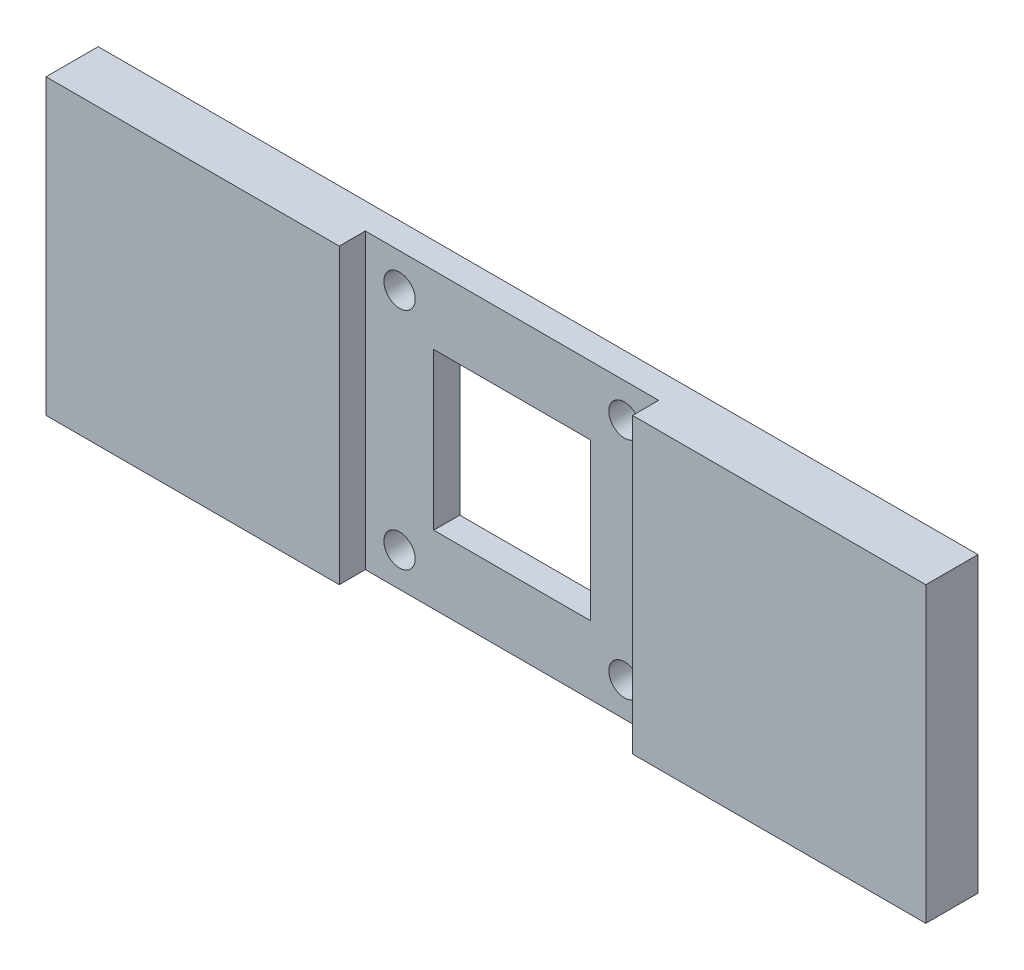
ISO-10303-21;
HEADER;
FILE_DESCRIPTION(('STEP AP214'),'2;1');
FILE_NAME('part.step','',(''),(''),'','','');
FILE_SCHEMA(('AUTOMOTIVE_DESIGN { 1 0 10303 214 1 1 1 1 }'));
ENDSEC;
DATA;
#1=APPLICATION_CONTEXT('core data for automotive mechanical design processes');
#2=APPLICATION_PROTOCOL_DEFINITION('international standard','automotive_design',2000,#1);
#3=PRODUCT_CONTEXT('',#1,'mechanical');
#4=PRODUCT('Part','Part','',(#3));
#5=PRODUCT_RELATED_PRODUCT_CATEGORY('part','',(#4));
#6=PRODUCT_DEFINITION_FORMATION('','',#4);
#7=PRODUCT_DEFINITION_CONTEXT('part definition',#1,'design');
#8=PRODUCT_DEFINITION('design','',#6,#7);
#9=PRODUCT_DEFINITION_SHAPE('','',#8);
#10=(LENGTH_UNIT() NAMED_UNIT(*) SI_UNIT(.MILLI.,.METRE.));
#11=(NAMED_UNIT(*) PLANE_ANGLE_UNIT() SI_UNIT($,.RADIAN.));
#12=(NAMED_UNIT(*) SI_UNIT($,.STERADIAN.) SOLID_ANGLE_UNIT());
#13=UNCERTAINTY_MEASURE_WITH_UNIT(LENGTH_MEASURE(1.E-05),#10,'distance_accuracy_value','');
#14=(GEOMETRIC_REPRESENTATION_CONTEXT(3) GLOBAL_UNCERTAINTY_ASSIGNED_CONTEXT((#13)) GLOBAL_UNIT_ASSIGNED_CONTEXT((#10,
#11,#12)) REPRESENTATION_CONTEXT('',''));
#15=CARTESIAN_POINT('',(0.,0.,0.));
#16=DIRECTION('',(0.,0.,1.));
#17=DIRECTION('',(1.,0.,0.));
#18=AXIS2_PLACEMENT_3D('',#15,#16,#17);
#19=CARTESIAN_POINT('',(-175.,28.1,10.));
#20=DIRECTION('',(0.,-1.,0.));
#21=DIRECTION('',(0.,0.,-1.));
#22=AXIS2_PLACEMENT_3D('',#19,#20,#21);
#23=PLANE('',#22);
#24=DIRECTION('',(-1.,0.,0.));
#25=VECTOR('',#24,1.);
#26=CARTESIAN_POINT('',(-175.,28.1,10.));
#27=LINE('',#26,#25);
#28=CARTESIAN_POINT('',(84.3,28.1,10.));
#29=VERTEX_POINT('',#28);
#30=CARTESIAN_POINT('',(28.1,28.1,10.));
#31=VERTEX_POINT('',#30);
#32=EDGE_CURVE('E142',#29,#31,#27,.T.);
#33=ORIENTED_EDGE('',*,*,#32,.F.);
#34=DIRECTION('',(0.,0.,1.));
#35=VECTOR('',#34,1.);
#36=CARTESIAN_POINT('',(84.3,28.1,0.));
#37=LINE('',#36,#35);
#38=CARTESIAN_POINT('',(84.3,28.1,0.));
#39=VERTEX_POINT('',#38);
#40=EDGE_CURVE('E11',#39,#29,#37,.T.);
#41=ORIENTED_EDGE('',*,*,#40,.F.);
#42=DIRECTION('',(-1.,0.,0.));
#43=VECTOR('',#42,1.);
#44=CARTESIAN_POINT('',(-175.,28.1,0.));
#45=LINE('',#44,#43);
#46=CARTESIAN_POINT('',(-84.3,28.1,0.));
#47=VERTEX_POINT('',#46);
#48=EDGE_CURVE('E139',#39,#47,#45,.T.);
#49=ORIENTED_EDGE('',*,*,#48,.T.);
#50=DIRECTION('',(0.,0.,1.));
#51=VECTOR('',#50,1.);
#52=CARTESIAN_POINT('',(-84.3,28.1,0.));
#53=LINE('',#52,#51);
#54=CARTESIAN_POINT('',(-84.3,28.1,10.));
#55=VERTEX_POINT('',#54);
#56=EDGE_CURVE('E152',#47,#55,#53,.T.);
#57=ORIENTED_EDGE('',*,*,#56,.T.);
#58=CARTESIAN_POINT('',(-28.1,28.1,10.));
#59=VERTEX_POINT('',#58);
#60=EDGE_CURVE('E161',#59,#55,#27,.T.);
#61=ORIENTED_EDGE('',*,*,#60,.F.);
#62=DIRECTION('',(0.,0.,1.));
#63=VECTOR('',#62,1.);
#64=CARTESIAN_POINT('',(-28.1,28.1,5.));
#65=LINE('',#64,#63);
#66=CARTESIAN_POINT('',(-28.1,28.1,5.));
#67=VERTEX_POINT('',#66);
#68=EDGE_CURVE('E164',#67,#59,#65,.T.);
#69=ORIENTED_EDGE('',*,*,#68,.F.);
#70=DIRECTION('',(-1.,0.,0.));
#71=VECTOR('',#70,1.);
#72=CARTESIAN_POINT('',(-28.1,28.1,5.));
#73=LINE('',#72,#71);
#74=CARTESIAN_POINT('',(28.1,28.1,5.));
#75=VERTEX_POINT('',#74);
#76=EDGE_CURVE('E192',#75,#67,#73,.T.);
#77=ORIENTED_EDGE('',*,*,#76,.F.);
#78=DIRECTION('',(0.,0.,1.));
#79=VECTOR('',#78,1.);
#80=CARTESIAN_POINT('',(28.1,28.1,5.));
#81=LINE('',#80,#79);
#82=EDGE_CURVE('E148',#75,#31,#81,.T.);
#83=ORIENTED_EDGE('',*,*,#82,.T.);
#84=EDGE_LOOP('',(#33,#41,#49,#57,#61,#69,#77,#83));
#85=FACE_BOUND('',#84,.T.);
#86=ADVANCED_FACE('F38',(#85),#23,.F.);
#87=CARTESIAN_POINT('',(-175.,-28.1,10.));
#88=DIRECTION('',(0.,1.,0.));
#89=DIRECTION('',(0.,0.,1.));
#90=AXIS2_PLACEMENT_3D('',#87,#88,#89);
#91=PLANE('',#90);
#92=DIRECTION('',(1.,0.,0.));
#93=VECTOR('',#92,1.);
#94=CARTESIAN_POINT('',(-175.,-28.1,0.));
#95=LINE('',#94,#93);
#96=CARTESIAN_POINT('',(-84.3,-28.1,0.));
#97=VERTEX_POINT('',#96);
#98=CARTESIAN_POINT('',(84.3,-28.1,0.));
#99=VERTEX_POINT('',#98);
#100=EDGE_CURVE('E130',#97,#99,#95,.T.);
#101=ORIENTED_EDGE('',*,*,#100,.T.);
#102=DIRECTION('',(0.,0.,1.));
#103=VECTOR('',#102,1.);
#104=CARTESIAN_POINT('',(84.3,-28.1,0.));
#105=LINE('',#104,#103);
#106=CARTESIAN_POINT('',(84.3,-28.1,10.));
#107=VERTEX_POINT('',#106);
#108=EDGE_CURVE('E121',#99,#107,#105,.T.);
#109=ORIENTED_EDGE('',*,*,#108,.T.);
#110=DIRECTION('',(1.,0.,0.));
#111=VECTOR('',#110,1.);
#112=CARTESIAN_POINT('',(-175.,-28.1,10.));
#113=LINE('',#112,#111);
#114=CARTESIAN_POINT('',(28.1,-28.1,10.));
#115=VERTEX_POINT('',#114);
#116=EDGE_CURVE('E160',#115,#107,#113,.T.);
#117=ORIENTED_EDGE('',*,*,#116,.F.);
#118=DIRECTION('',(0.,0.,1.));
#119=VECTOR('',#118,1.);
#120=CARTESIAN_POINT('',(28.1,-28.1,5.));
#121=LINE('',#120,#119);
#122=CARTESIAN_POINT('',(28.1,-28.1,5.));
#123=VERTEX_POINT('',#122);
#124=EDGE_CURVE('E172',#123,#115,#121,.T.);
#125=ORIENTED_EDGE('',*,*,#124,.F.);
#126=DIRECTION('',(1.,0.,0.));
#127=VECTOR('',#126,1.);
#128=CARTESIAN_POINT('',(-28.1,-28.1,5.));
#129=LINE('',#128,#127);
#130=CARTESIAN_POINT('',(-28.1,-28.1,5.));
#131=VERTEX_POINT('',#130);
#132=EDGE_CURVE('E183',#131,#123,#129,.T.);
#133=ORIENTED_EDGE('',*,*,#132,.F.);
#134=DIRECTION('',(0.,0.,1.));
#135=VECTOR('',#134,1.);
#136=CARTESIAN_POINT('',(-28.1,-28.1,5.));
#137=LINE('',#136,#135);
#138=CARTESIAN_POINT('',(-28.1,-28.1,10.));
#139=VERTEX_POINT('',#138);
#140=EDGE_CURVE('E129',#131,#139,#137,.T.);
#141=ORIENTED_EDGE('',*,*,#140,.T.);
#142=CARTESIAN_POINT('',(-84.3,-28.1,10.));
#143=VERTEX_POINT('',#142);
#144=EDGE_CURVE('E157',#143,#139,#113,.T.);
#145=ORIENTED_EDGE('',*,*,#144,.F.);
#146=DIRECTION('',(0.,0.,1.));
#147=VECTOR('',#146,1.);
#148=CARTESIAN_POINT('',(-84.3,-28.1,0.));
#149=LINE('',#148,#147);
#150=EDGE_CURVE('E146',#97,#143,#149,.T.);
#151=ORIENTED_EDGE('',*,*,#150,.F.);
#152=EDGE_LOOP('',(#101,#109,#117,#125,#133,#141,#145,#151));
#153=FACE_BOUND('',#152,.T.);
#154=ADVANCED_FACE('F144',(#153),#91,.F.);
#155=CARTESIAN_POINT('',(0.,0.,10.));
#156=DIRECTION('',(0.,0.,-1.));
#157=DIRECTION('',(-1.,0.,0.));
#158=AXIS2_PLACEMENT_3D('',#155,#156,#157);
#159=PLANE('',#158);
#160=ORIENTED_EDGE('',*,*,#60,.T.);
#161=DIRECTION('',(0.,1.,0.));
#162=VECTOR('',#161,1.);
#163=CARTESIAN_POINT('',(-84.3,28.1,10.));
#164=LINE('',#163,#162);
#165=EDGE_CURVE('E255',#143,#55,#164,.T.);
#166=ORIENTED_EDGE('',*,*,#165,.F.);
#167=ORIENTED_EDGE('',*,*,#144,.T.);
#168=DIRECTION('',(0.,-1.,0.));
#169=VECTOR('',#168,1.);
#170=CARTESIAN_POINT('',(-28.1,-28.1,10.));
#171=LINE('',#170,#169);
#172=EDGE_CURVE('E168',#59,#139,#171,.T.);
#173=ORIENTED_EDGE('',*,*,#172,.F.);
#174=EDGE_LOOP('',(#160,#166,#167,#173));
#175=FACE_BOUND('',#174,.T.);
#176=ADVANCED_FACE('F290',(#175),#159,.F.);
#177=ORIENTED_EDGE('',*,*,#116,.T.);
#178=DIRECTION('',(0.,-1.,0.));
#179=VECTOR('',#178,1.);
#180=CARTESIAN_POINT('',(84.3,28.1,10.));
#181=LINE('',#180,#179);
#182=EDGE_CURVE('E48',#29,#107,#181,.T.);
#183=ORIENTED_EDGE('',*,*,#182,.F.);
#184=ORIENTED_EDGE('',*,*,#32,.T.);
#185=DIRECTION('',(0.,1.,0.));
#186=VECTOR('',#185,1.);
#187=CARTESIAN_POINT('',(28.1,-28.1,10.));
#188=LINE('',#187,#186);
#189=EDGE_CURVE('E175',#115,#31,#188,.T.);
#190=ORIENTED_EDGE('',*,*,#189,.F.);
#191=EDGE_LOOP('',(#177,#183,#184,#190));
#192=FACE_BOUND('',#191,.T.);
#193=ADVANCED_FACE('F317',(#192),#159,.F.);
#194=CARTESIAN_POINT('',(0.,0.,0.));
#195=DIRECTION('',(0.,0.,-1.));
#196=DIRECTION('',(-1.,0.,0.));
#197=AXIS2_PLACEMENT_3D('',#194,#195,#196);
#198=PLANE('',#197);
#199=DIRECTION('',(0.,-1.,0.));
#200=VECTOR('',#199,1.);
#201=CARTESIAN_POINT('',(84.3,28.1,0.));
#202=LINE('',#201,#200);
#203=EDGE_CURVE('E41',#39,#99,#202,.T.);
#204=ORIENTED_EDGE('',*,*,#203,.T.);
#205=ORIENTED_EDGE('',*,*,#100,.F.);
#206=DIRECTION('',(0.,1.,0.));
#207=VECTOR('',#206,1.);
#208=CARTESIAN_POINT('',(-84.3,28.1,0.));
#209=LINE('',#208,#207);
#210=EDGE_CURVE('E141',#97,#47,#209,.T.);
#211=ORIENTED_EDGE('',*,*,#210,.T.);
#212=ORIENTED_EDGE('',*,*,#48,.F.);
#213=EDGE_LOOP('',(#204,#205,#211,#212));
#214=FACE_BOUND('',#213,.T.);
#215=CARTESIAN_POINT('',(21.55,-21.55,0.));
#216=DIRECTION('',(0.,0.,1.));
#217=DIRECTION('',(1.,0.,0.));
#218=AXIS2_PLACEMENT_3D('',#215,#216,#217);
#219=CIRCLE('',#218,3.);
#220=CARTESIAN_POINT('',(24.55,-21.55,0.));
#221=VERTEX_POINT('',#220);
#222=EDGE_CURVE('E257',#221,#221,#219,.T.);
#223=ORIENTED_EDGE('',*,*,#222,.T.);
#224=EDGE_LOOP('',(#223));
#225=FACE_BOUND('',#224,.T.);
#226=CARTESIAN_POINT('',(-21.55,21.55,0.));
#227=DIRECTION('',(0.,0.,1.));
#228=DIRECTION('',(1.,0.,0.));
#229=AXIS2_PLACEMENT_3D('',#226,#227,#228);
#230=CIRCLE('',#229,3.);
#231=CARTESIAN_POINT('',(-18.55,21.55,0.));
#232=VERTEX_POINT('',#231);
#233=EDGE_CURVE('E261',#232,#232,#230,.T.);
#234=ORIENTED_EDGE('',*,*,#233,.T.);
#235=EDGE_LOOP('',(#234));
#236=FACE_BOUND('',#235,.T.);
#237=CARTESIAN_POINT('',(-21.55,-21.55,0.));
#238=DIRECTION('',(0.,0.,1.));
#239=DIRECTION('',(1.,0.,0.));
#240=AXIS2_PLACEMENT_3D('',#237,#238,#239);
#241=CIRCLE('',#240,3.);
#242=CARTESIAN_POINT('',(-18.55,-21.55,0.));
#243=VERTEX_POINT('',#242);
#244=EDGE_CURVE('E250',#243,#243,#241,.T.);
#245=ORIENTED_EDGE('',*,*,#244,.T.);
#246=EDGE_LOOP('',(#245));
#247=FACE_BOUND('',#246,.T.);
#248=CARTESIAN_POINT('',(21.55,21.55,0.));
#249=DIRECTION('',(0.,0.,1.));
#250=DIRECTION('',(1.,0.,0.));
#251=AXIS2_PLACEMENT_3D('',#248,#249,#250);
#252=CIRCLE('',#251,3.);
#253=CARTESIAN_POINT('',(24.55,21.55,0.));
#254=VERTEX_POINT('',#253);
#255=EDGE_CURVE('E242',#254,#254,#252,.T.);
#256=ORIENTED_EDGE('',*,*,#255,.T.);
#257=EDGE_LOOP('',(#256));
#258=FACE_BOUND('',#257,.T.);
#259=DIRECTION('',(0.,1.,0.));
#260=VECTOR('',#259,1.);
#261=CARTESIAN_POINT('',(15.,-15.,0.));
#262=LINE('',#261,#260);
#263=CARTESIAN_POINT('',(15.,-15.,0.));
#264=VERTEX_POINT('',#263);
#265=CARTESIAN_POINT('',(15.,15.,0.));
#266=VERTEX_POINT('',#265);
#267=EDGE_CURVE('E238',#264,#266,#262,.T.);
#268=ORIENTED_EDGE('',*,*,#267,.T.);
#269=DIRECTION('',(-1.,0.,0.));
#270=VECTOR('',#269,1.);
#271=CARTESIAN_POINT('',(-15.,15.,0.));
#272=LINE('',#271,#270);
#273=CARTESIAN_POINT('',(-15.,15.,0.));
#274=VERTEX_POINT('',#273);
#275=EDGE_CURVE('E234',#266,#274,#272,.T.);
#276=ORIENTED_EDGE('',*,*,#275,.T.);
#277=DIRECTION('',(0.,-1.,0.));
#278=VECTOR('',#277,1.);
#279=CARTESIAN_POINT('',(-15.,-15.,0.));
#280=LINE('',#279,#278);
#281=CARTESIAN_POINT('',(-15.,-15.,0.));
#282=VERTEX_POINT('',#281);
#283=EDGE_CURVE('E230',#274,#282,#280,.T.);
#284=ORIENTED_EDGE('',*,*,#283,.T.);
#285=DIRECTION('',(1.,0.,0.));
#286=VECTOR('',#285,1.);
#287=CARTESIAN_POINT('',(-15.,-15.,0.));
#288=LINE('',#287,#286);
#289=EDGE_CURVE('E182',#282,#264,#288,.T.);
#290=ORIENTED_EDGE('',*,*,#289,.T.);
#291=EDGE_LOOP('',(#268,#276,#284,#290));
#292=FACE_BOUND('',#291,.T.);
#293=ADVANCED_FACE('F135',(#214,#225,#236,#247,#258,#292),#198,.T.);
#294=CARTESIAN_POINT('',(28.1,-28.1,5.));
#295=DIRECTION('',(1.,0.,0.));
#296=DIRECTION('',(0.,0.,-1.));
#297=AXIS2_PLACEMENT_3D('',#294,#295,#296);
#298=PLANE('',#297);
#299=ORIENTED_EDGE('',*,*,#189,.T.);
#300=ORIENTED_EDGE('',*,*,#82,.F.);
#301=DIRECTION('',(0.,1.,0.));
#302=VECTOR('',#301,1.);
#303=CARTESIAN_POINT('',(28.1,-28.1,5.));
#304=LINE('',#303,#302);
#305=EDGE_CURVE('E167',#123,#75,#304,.T.);
#306=ORIENTED_EDGE('',*,*,#305,.F.);
#307=ORIENTED_EDGE('',*,*,#124,.T.);
#308=EDGE_LOOP('',(#299,#300,#306,#307));
#309=FACE_BOUND('',#308,.T.);
#310=ADVANCED_FACE('F325',(#309),#298,.F.);
#311=CARTESIAN_POINT('',(-28.1,-28.1,5.));
#312=DIRECTION('',(-1.,0.,0.));
#313=DIRECTION('',(0.,0.,1.));
#314=AXIS2_PLACEMENT_3D('',#311,#312,#313);
#315=PLANE('',#314);
#316=ORIENTED_EDGE('',*,*,#172,.T.);
#317=ORIENTED_EDGE('',*,*,#140,.F.);
#318=DIRECTION('',(0.,-1.,0.));
#319=VECTOR('',#318,1.);
#320=CARTESIAN_POINT('',(-28.1,-28.1,5.));
#321=LINE('',#320,#319);
#322=EDGE_CURVE('E188',#67,#131,#321,.T.);
#323=ORIENTED_EDGE('',*,*,#322,.F.);
#324=ORIENTED_EDGE('',*,*,#68,.T.);
#325=EDGE_LOOP('',(#316,#317,#323,#324));
#326=FACE_BOUND('',#325,.T.);
#327=ADVANCED_FACE('F328',(#326),#315,.F.);
#328=CARTESIAN_POINT('',(0.,0.,5.));
#329=DIRECTION('',(0.,0.,-1.));
#330=DIRECTION('',(-1.,0.,0.));
#331=AXIS2_PLACEMENT_3D('',#328,#329,#330);
#332=PLANE('',#331);
#333=CARTESIAN_POINT('',(21.55,-21.55,5.));
#334=DIRECTION('',(0.,0.,1.));
#335=DIRECTION('',(1.,0.,0.));
#336=AXIS2_PLACEMENT_3D('',#333,#334,#335);
#337=CIRCLE('',#336,3.);
#338=CARTESIAN_POINT('',(24.55,-21.55,5.));
#339=VERTEX_POINT('',#338);
#340=EDGE_CURVE('E251',#339,#339,#337,.T.);
#341=ORIENTED_EDGE('',*,*,#340,.F.);
#342=EDGE_LOOP('',(#341));
#343=FACE_BOUND('',#342,.T.);
#344=CARTESIAN_POINT('',(-21.55,21.55,5.));
#345=DIRECTION('',(0.,0.,1.));
#346=DIRECTION('',(1.,0.,0.));
#347=AXIS2_PLACEMENT_3D('',#344,#345,#346);
#348=CIRCLE('',#347,3.);
#349=CARTESIAN_POINT('',(-18.55,21.55,5.));
#350=VERTEX_POINT('',#349);
#351=EDGE_CURVE('E256',#350,#350,#348,.T.);
#352=ORIENTED_EDGE('',*,*,#351,.F.);
#353=EDGE_LOOP('',(#352));
#354=FACE_BOUND('',#353,.T.);
#355=CARTESIAN_POINT('',(-21.55,-21.55,5.));
#356=DIRECTION('',(0.,0.,1.));
#357=DIRECTION('',(1.,0.,0.));
#358=AXIS2_PLACEMENT_3D('',#355,#356,#357);
#359=CIRCLE('',#358,3.);
#360=CARTESIAN_POINT('',(-18.55,-21.55,5.));
#361=VERTEX_POINT('',#360);
#362=EDGE_CURVE('E246',#361,#361,#359,.T.);
#363=ORIENTED_EDGE('',*,*,#362,.F.);
#364=EDGE_LOOP('',(#363));
#365=FACE_BOUND('',#364,.T.);
#366=CARTESIAN_POINT('',(21.55,21.55,5.));
#367=DIRECTION('',(0.,0.,1.));
#368=DIRECTION('',(1.,0.,0.));
#369=AXIS2_PLACEMENT_3D('',#366,#367,#368);
#370=CIRCLE('',#369,3.);
#371=CARTESIAN_POINT('',(24.55,21.55,5.));
#372=VERTEX_POINT('',#371);
#373=EDGE_CURVE('E203',#372,#372,#370,.T.);
#374=ORIENTED_EDGE('',*,*,#373,.F.);
#375=EDGE_LOOP('',(#374));
#376=FACE_BOUND('',#375,.T.);
#377=DIRECTION('',(-1.,0.,0.));
#378=VECTOR('',#377,1.);
#379=CARTESIAN_POINT('',(-15.,15.,5.));
#380=LINE('',#379,#378);
#381=CARTESIAN_POINT('',(15.,15.,5.));
#382=VERTEX_POINT('',#381);
#383=CARTESIAN_POINT('',(-15.,15.,5.));
#384=VERTEX_POINT('',#383);
#385=EDGE_CURVE('E204',#382,#384,#380,.T.);
#386=ORIENTED_EDGE('',*,*,#385,.F.);
#387=DIRECTION('',(0.,1.,0.));
#388=VECTOR('',#387,1.);
#389=CARTESIAN_POINT('',(15.,-15.,5.));
#390=LINE('',#389,#388);
#391=CARTESIAN_POINT('',(15.,-15.,5.));
#392=VERTEX_POINT('',#391);
#393=EDGE_CURVE('E187',#392,#382,#390,.T.);
#394=ORIENTED_EDGE('',*,*,#393,.F.);
#395=DIRECTION('',(1.,0.,0.));
#396=VECTOR('',#395,1.);
#397=CARTESIAN_POINT('',(-15.,-15.,5.));
#398=LINE('',#397,#396);
#399=CARTESIAN_POINT('',(-15.,-15.,5.));
#400=VERTEX_POINT('',#399);
#401=EDGE_CURVE('E212',#400,#392,#398,.T.);
#402=ORIENTED_EDGE('',*,*,#401,.F.);
#403=DIRECTION('',(0.,-1.,0.));
#404=VECTOR('',#403,1.);
#405=CARTESIAN_POINT('',(-15.,-15.,5.));
#406=LINE('',#405,#404);
#407=EDGE_CURVE('E208',#384,#400,#406,.T.);
#408=ORIENTED_EDGE('',*,*,#407,.F.);
#409=EDGE_LOOP('',(#386,#394,#402,#408));
#410=FACE_BOUND('',#409,.T.);
#411=ORIENTED_EDGE('',*,*,#305,.T.);
#412=ORIENTED_EDGE('',*,*,#76,.T.);
#413=ORIENTED_EDGE('',*,*,#322,.T.);
#414=ORIENTED_EDGE('',*,*,#132,.T.);
#415=EDGE_LOOP('',(#411,#412,#413,#414));
#416=FACE_BOUND('',#415,.T.);
#417=ADVANCED_FACE('F332',(#343,#354,#365,#376,#410,#416),#332,.F.);
#418=CARTESIAN_POINT('',(15.,-15.,0.));
#419=DIRECTION('',(1.,0.,0.));
#420=DIRECTION('',(0.,0.,-1.));
#421=AXIS2_PLACEMENT_3D('',#418,#419,#420);
#422=PLANE('',#421);
#423=ORIENTED_EDGE('',*,*,#393,.T.);
#424=DIRECTION('',(0.,0.,1.));
#425=VECTOR('',#424,1.);
#426=CARTESIAN_POINT('',(15.,15.,0.));
#427=LINE('',#426,#425);
#428=EDGE_CURVE('E199',#266,#382,#427,.T.);
#429=ORIENTED_EDGE('',*,*,#428,.F.);
#430=ORIENTED_EDGE('',*,*,#267,.F.);
#431=DIRECTION('',(0.,0.,1.));
#432=VECTOR('',#431,1.);
#433=CARTESIAN_POINT('',(15.,-15.,0.));
#434=LINE('',#433,#432);
#435=EDGE_CURVE('E213',#264,#392,#434,.T.);
#436=ORIENTED_EDGE('',*,*,#435,.T.);
#437=EDGE_LOOP('',(#423,#429,#430,#436));
#438=FACE_BOUND('',#437,.T.);
#439=ADVANCED_FACE('F336',(#438),#422,.F.);
#440=CARTESIAN_POINT('',(-15.,-15.,0.));
#441=DIRECTION('',(0.,-1.,0.));
#442=DIRECTION('',(0.,0.,-1.));
#443=AXIS2_PLACEMENT_3D('',#440,#441,#442);
#444=PLANE('',#443);
#445=ORIENTED_EDGE('',*,*,#401,.T.);
#446=ORIENTED_EDGE('',*,*,#435,.F.);
#447=ORIENTED_EDGE('',*,*,#289,.F.);
#448=DIRECTION('',(0.,0.,1.));
#449=VECTOR('',#448,1.);
#450=CARTESIAN_POINT('',(-15.,-15.,0.));
#451=LINE('',#450,#449);
#452=EDGE_CURVE('E209',#282,#400,#451,.T.);
#453=ORIENTED_EDGE('',*,*,#452,.T.);
#454=EDGE_LOOP('',(#445,#446,#447,#453));
#455=FACE_BOUND('',#454,.T.);
#456=ADVANCED_FACE('F340',(#455),#444,.F.);
#457=CARTESIAN_POINT('',(-15.,-15.,0.));
#458=DIRECTION('',(-1.,0.,0.));
#459=DIRECTION('',(0.,0.,1.));
#460=AXIS2_PLACEMENT_3D('',#457,#458,#459);
#461=PLANE('',#460);
#462=ORIENTED_EDGE('',*,*,#407,.T.);
#463=ORIENTED_EDGE('',*,*,#452,.F.);
#464=ORIENTED_EDGE('',*,*,#283,.F.);
#465=DIRECTION('',(0.,0.,1.));
#466=VECTOR('',#465,1.);
#467=CARTESIAN_POINT('',(-15.,15.,0.));
#468=LINE('',#467,#466);
#469=EDGE_CURVE('E205',#274,#384,#468,.T.);
#470=ORIENTED_EDGE('',*,*,#469,.T.);
#471=EDGE_LOOP('',(#462,#463,#464,#470));
#472=FACE_BOUND('',#471,.T.);
#473=ADVANCED_FACE('F346',(#472),#461,.F.);
#474=CARTESIAN_POINT('',(-15.,15.,0.));
#475=DIRECTION('',(0.,1.,0.));
#476=DIRECTION('',(0.,0.,1.));
#477=AXIS2_PLACEMENT_3D('',#474,#475,#476);
#478=PLANE('',#477);
#479=ORIENTED_EDGE('',*,*,#385,.T.);
#480=ORIENTED_EDGE('',*,*,#469,.F.);
#481=ORIENTED_EDGE('',*,*,#275,.F.);
#482=ORIENTED_EDGE('',*,*,#428,.T.);
#483=EDGE_LOOP('',(#479,#480,#481,#482));
#484=FACE_BOUND('',#483,.T.);
#485=ADVANCED_FACE('F342',(#484),#478,.F.);
#486=CARTESIAN_POINT('',(21.55,21.55,0.));
#487=DIRECTION('',(0.,0.,1.));
#488=DIRECTION('',(1.,0.,0.));
#489=AXIS2_PLACEMENT_3D('',#486,#487,#488);
#490=CYLINDRICAL_SURFACE('',#489,3.);
#491=ORIENTED_EDGE('',*,*,#255,.F.);
#492=EDGE_LOOP('',(#491));
#493=FACE_BOUND('',#492,.T.);
#494=ORIENTED_EDGE('',*,*,#373,.T.);
#495=EDGE_LOOP('',(#494));
#496=FACE_BOUND('',#495,.T.);
#497=ADVANCED_FACE('F345',(#493,#496),#490,.F.);
#498=CARTESIAN_POINT('',(-21.55,-21.55,0.));
#499=DIRECTION('',(0.,0.,1.));
#500=DIRECTION('',(1.,0.,0.));
#501=AXIS2_PLACEMENT_3D('',#498,#499,#500);
#502=CYLINDRICAL_SURFACE('',#501,3.);
#503=ORIENTED_EDGE('',*,*,#244,.F.);
#504=EDGE_LOOP('',(#503));
#505=FACE_BOUND('',#504,.T.);
#506=ORIENTED_EDGE('',*,*,#362,.T.);
#507=EDGE_LOOP('',(#506));
#508=FACE_BOUND('',#507,.T.);
#509=ADVANCED_FACE('F355',(#505,#508),#502,.F.);
#510=CARTESIAN_POINT('',(-21.55,21.55,0.));
#511=DIRECTION('',(0.,0.,1.));
#512=DIRECTION('',(1.,0.,0.));
#513=AXIS2_PLACEMENT_3D('',#510,#511,#512);
#514=CYLINDRICAL_SURFACE('',#513,3.);
#515=ORIENTED_EDGE('',*,*,#233,.F.);
#516=EDGE_LOOP('',(#515));
#517=FACE_BOUND('',#516,.T.);
#518=ORIENTED_EDGE('',*,*,#351,.T.);
#519=EDGE_LOOP('',(#518));
#520=FACE_BOUND('',#519,.T.);
#521=ADVANCED_FACE('F306',(#517,#520),#514,.F.);
#522=CARTESIAN_POINT('',(21.55,-21.55,0.));
#523=DIRECTION('',(0.,0.,1.));
#524=DIRECTION('',(1.,0.,0.));
#525=AXIS2_PLACEMENT_3D('',#522,#523,#524);
#526=CYLINDRICAL_SURFACE('',#525,3.);
#527=ORIENTED_EDGE('',*,*,#222,.F.);
#528=EDGE_LOOP('',(#527));
#529=FACE_BOUND('',#528,.T.);
#530=ORIENTED_EDGE('',*,*,#340,.T.);
#531=EDGE_LOOP('',(#530));
#532=FACE_BOUND('',#531,.T.);
#533=ADVANCED_FACE('F298',(#529,#532),#526,.F.);
#534=CARTESIAN_POINT('',(-84.3,28.1,0.));
#535=DIRECTION('',(1.,0.,0.));
#536=DIRECTION('',(0.,0.,-1.));
#537=AXIS2_PLACEMENT_3D('',#534,#535,#536);
#538=PLANE('',#537);
#539=ORIENTED_EDGE('',*,*,#165,.T.);
#540=ORIENTED_EDGE('',*,*,#56,.F.);
#541=ORIENTED_EDGE('',*,*,#210,.F.);
#542=ORIENTED_EDGE('',*,*,#150,.T.);
#543=EDGE_LOOP('',(#539,#540,#541,#542));
#544=FACE_BOUND('',#543,.T.);
#545=ADVANCED_FACE('F296',(#544),#538,.F.);
#546=CARTESIAN_POINT('',(84.3,28.1,0.));
#547=DIRECTION('',(-1.,0.,0.));
#548=DIRECTION('',(0.,0.,1.));
#549=AXIS2_PLACEMENT_3D('',#546,#547,#548);
#550=PLANE('',#549);
#551=ORIENTED_EDGE('',*,*,#182,.T.);
#552=ORIENTED_EDGE('',*,*,#108,.F.);
#553=ORIENTED_EDGE('',*,*,#203,.F.);
#554=ORIENTED_EDGE('',*,*,#40,.T.);
#555=EDGE_LOOP('',(#551,#552,#553,#554));
#556=FACE_BOUND('',#555,.T.);
#557=ADVANCED_FACE('F123',(#556),#550,.F.);
#558=CLOSED_SHELL('',(#86,#154,#176,#193,#293,#310,#327,#417,#439,#456,#473,#485,#497,#509,#521,
#533,#545,#557));
#559=MANIFOLD_SOLID_BREP('B2',#558);
#560=ADVANCED_BREP_SHAPE_REPRESENTATION('',(#18,#559),#14);
#561=SHAPE_DEFINITION_REPRESENTATION(#9,#560);
ENDSEC;
END-ISO-10303-21;
